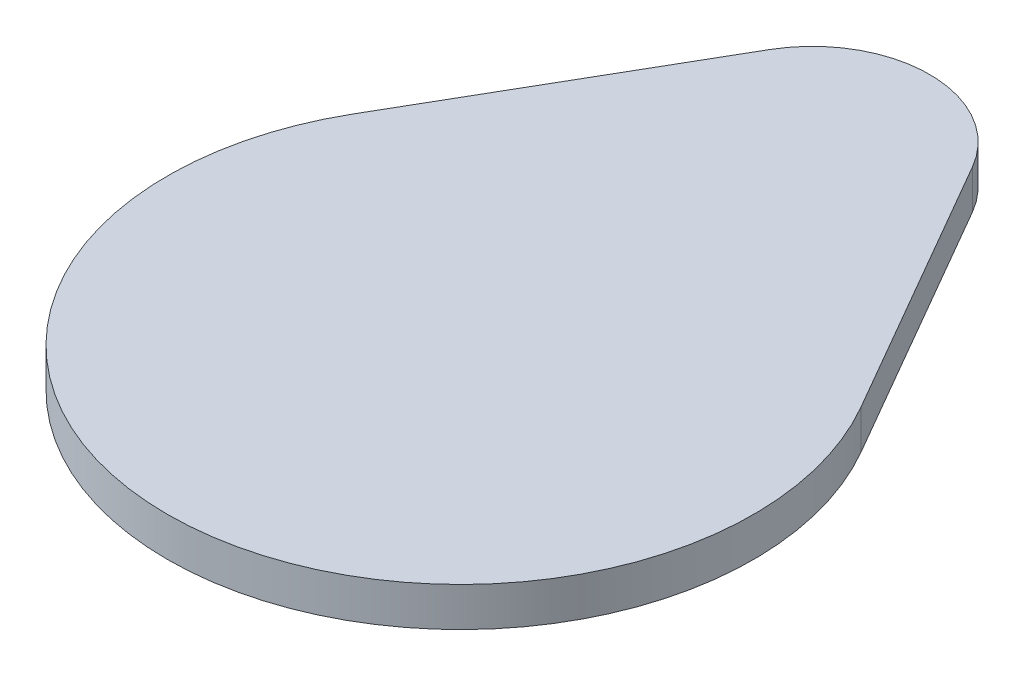
ISO-10303-21;
HEADER;
FILE_DESCRIPTION(('STEP AP214'),'2;1');
FILE_NAME('part.step','',(''),(''),'','','');
FILE_SCHEMA(('AUTOMOTIVE_DESIGN { 1 0 10303 214 1 1 1 1 }'));
ENDSEC;
DATA;
#1=APPLICATION_CONTEXT('core data for automotive mechanical design processes');
#2=APPLICATION_PROTOCOL_DEFINITION('international standard','automotive_design',2000,#1);
#3=PRODUCT_CONTEXT('',#1,'mechanical');
#4=PRODUCT('Part','Part','',(#3));
#5=PRODUCT_RELATED_PRODUCT_CATEGORY('part','',(#4));
#6=PRODUCT_DEFINITION_FORMATION('','',#4);
#7=PRODUCT_DEFINITION_CONTEXT('part definition',#1,'design');
#8=PRODUCT_DEFINITION('design','',#6,#7);
#9=PRODUCT_DEFINITION_SHAPE('','',#8);
#10=(LENGTH_UNIT() NAMED_UNIT(*) SI_UNIT(.MILLI.,.METRE.));
#11=(NAMED_UNIT(*) PLANE_ANGLE_UNIT() SI_UNIT($,.RADIAN.));
#12=(NAMED_UNIT(*) SI_UNIT($,.STERADIAN.) SOLID_ANGLE_UNIT());
#13=UNCERTAINTY_MEASURE_WITH_UNIT(LENGTH_MEASURE(1.E-05),#10,'distance_accuracy_value','');
#14=(GEOMETRIC_REPRESENTATION_CONTEXT(3) GLOBAL_UNCERTAINTY_ASSIGNED_CONTEXT((#13)) GLOBAL_UNIT_ASSIGNED_CONTEXT((#10,
#11,#12)) REPRESENTATION_CONTEXT('',''));
#15=CARTESIAN_POINT('',(0.,0.,0.));
#16=DIRECTION('',(0.,0.,1.));
#17=DIRECTION('',(1.,0.,0.));
#18=AXIS2_PLACEMENT_3D('',#15,#16,#17);
#19=CARTESIAN_POINT('',(-6.49519052838329,1.,-3.75));
#20=DIRECTION('',(0.866025403784439,0.,0.5));
#21=DIRECTION('',(0.5,0.,-0.866025403784439));
#22=AXIS2_PLACEMENT_3D('',#19,#20,#21);
#23=PLANE('',#22);
#24=DIRECTION('',(-0.5,0.,0.866025403784439));
#25=VECTOR('',#24,1.);
#26=CARTESIAN_POINT('',(-6.49519052838329,1.,-3.75));
#27=LINE('',#26,#25);
#28=CARTESIAN_POINT('',(-2.59807621135331,1.,-10.5));
#29=VERTEX_POINT('',#28);
#30=CARTESIAN_POINT('',(-6.49519052838329,1.,-3.75));
#31=VERTEX_POINT('',#30);
#32=EDGE_CURVE('E72',#29,#31,#27,.T.);
#33=ORIENTED_EDGE('',*,*,#32,.F.);
#34=DIRECTION('',(0.,-1.,0.));
#35=VECTOR('',#34,1.);
#36=CARTESIAN_POINT('',(-2.59807621135332,0.,-10.5));
#37=LINE('',#36,#35);
#38=CARTESIAN_POINT('',(-2.59807621135331,0.,-10.5));
#39=VERTEX_POINT('',#38);
#40=EDGE_CURVE('E95',#29,#39,#37,.T.);
#41=ORIENTED_EDGE('',*,*,#40,.T.);
#42=DIRECTION('',(-0.5,0.,0.866025403784439));
#43=VECTOR('',#42,1.);
#44=CARTESIAN_POINT('',(-6.49519052838329,0.,-3.75));
#45=LINE('',#44,#43);
#46=CARTESIAN_POINT('',(-6.49519052838329,0.,-3.75));
#47=VERTEX_POINT('',#46);
#48=EDGE_CURVE('E93',#39,#47,#45,.T.);
#49=ORIENTED_EDGE('',*,*,#48,.T.);
#50=DIRECTION('',(0.,-1.,0.));
#51=VECTOR('',#50,1.);
#52=CARTESIAN_POINT('',(-6.49519052838329,1.,-3.75));
#53=LINE('',#52,#51);
#54=EDGE_CURVE('E88',#31,#47,#53,.T.);
#55=ORIENTED_EDGE('',*,*,#54,.F.);
#56=EDGE_LOOP('',(#33,#41,#49,#55));
#57=FACE_BOUND('',#56,.T.);
#58=ADVANCED_FACE('F33',(#57),#23,.F.);
#59=CARTESIAN_POINT('',(0.,1.,0.));
#60=DIRECTION('',(0.,-1.,0.));
#61=DIRECTION('',(0.,0.,-1.));
#62=AXIS2_PLACEMENT_3D('',#59,#60,#61);
#63=CYLINDRICAL_SURFACE('',#62,7.5);
#64=CARTESIAN_POINT('',(0.,0.,0.));
#65=DIRECTION('',(0.,1.,0.));
#66=DIRECTION('',(0.,0.,1.));
#67=AXIS2_PLACEMENT_3D('',#64,#65,#66);
#68=CIRCLE('',#67,7.5);
#69=CARTESIAN_POINT('',(6.49519052838329,0.,-3.75));
#70=VERTEX_POINT('',#69);
#71=EDGE_CURVE('E102',#47,#70,#68,.T.);
#72=ORIENTED_EDGE('',*,*,#71,.T.);
#73=DIRECTION('',(0.,-1.,0.));
#74=VECTOR('',#73,1.);
#75=CARTESIAN_POINT('',(6.49519052838329,1.,-3.75));
#76=LINE('',#75,#74);
#77=CARTESIAN_POINT('',(6.49519052838329,1.,-3.75));
#78=VERTEX_POINT('',#77);
#79=EDGE_CURVE('E90',#78,#70,#76,.T.);
#80=ORIENTED_EDGE('',*,*,#79,.F.);
#81=CARTESIAN_POINT('',(0.,1.,0.));
#82=DIRECTION('',(0.,1.,0.));
#83=DIRECTION('',(0.,0.,1.));
#84=AXIS2_PLACEMENT_3D('',#81,#82,#83);
#85=CIRCLE('',#84,7.5);
#86=EDGE_CURVE('E75',#31,#78,#85,.T.);
#87=ORIENTED_EDGE('',*,*,#86,.F.);
#88=ORIENTED_EDGE('',*,*,#54,.T.);
#89=EDGE_LOOP('',(#72,#80,#87,#88));
#90=FACE_BOUND('',#89,.T.);
#91=ADVANCED_FACE('F87',(#90),#63,.T.);
#92=CARTESIAN_POINT('',(6.49519052838329,1.,-3.75));
#93=DIRECTION('',(0.866025403784439,0.,-0.5));
#94=DIRECTION('',(-0.5,0.,-0.866025403784439));
#95=AXIS2_PLACEMENT_3D('',#92,#93,#94);
#96=PLANE('',#95);
#97=DIRECTION('',(0.5,0.,0.866025403784439));
#98=VECTOR('',#97,1.);
#99=CARTESIAN_POINT('',(6.49519052838329,0.,-3.75));
#100=LINE('',#99,#98);
#101=CARTESIAN_POINT('',(2.59807621135332,0.,-10.5));
#102=VERTEX_POINT('',#101);
#103=EDGE_CURVE('E82',#102,#70,#100,.T.);
#104=ORIENTED_EDGE('',*,*,#103,.F.);
#105=DIRECTION('',(0.,-1.,0.));
#106=VECTOR('',#105,1.);
#107=CARTESIAN_POINT('',(2.59807621135332,1.,-10.5));
#108=LINE('',#107,#106);
#109=CARTESIAN_POINT('',(2.59807621135332,1.,-10.5));
#110=VERTEX_POINT('',#109);
#111=EDGE_CURVE('E41',#102,#110,#108,.F.);
#112=ORIENTED_EDGE('',*,*,#111,.T.);
#113=DIRECTION('',(0.5,0.,0.866025403784439));
#114=VECTOR('',#113,1.);
#115=CARTESIAN_POINT('',(6.49519052838329,1.,-3.75));
#116=LINE('',#115,#114);
#117=EDGE_CURVE('E91',#110,#78,#116,.T.);
#118=ORIENTED_EDGE('',*,*,#117,.T.);
#119=ORIENTED_EDGE('',*,*,#79,.T.);
#120=EDGE_LOOP('',(#104,#112,#118,#119));
#121=FACE_BOUND('',#120,.T.);
#122=ADVANCED_FACE('F105',(#121),#96,.T.);
#123=CARTESIAN_POINT('',(0.,1.,0.));
#124=DIRECTION('',(0.,1.,0.));
#125=DIRECTION('',(0.,0.,1.));
#126=AXIS2_PLACEMENT_3D('',#123,#124,#125);
#127=PLANE('',#126);
#128=ORIENTED_EDGE('',*,*,#117,.F.);
#129=CARTESIAN_POINT('',(0.,1.,-9.));
#130=DIRECTION('',(0.,1.,0.));
#131=DIRECTION('',(0.,0.,1.));
#132=AXIS2_PLACEMENT_3D('',#129,#130,#131);
#133=CIRCLE('',#132,3.);
#134=EDGE_CURVE('E11',#110,#29,#133,.T.);
#135=ORIENTED_EDGE('',*,*,#134,.T.);
#136=ORIENTED_EDGE('',*,*,#32,.T.);
#137=ORIENTED_EDGE('',*,*,#86,.T.);
#138=EDGE_LOOP('',(#128,#135,#136,#137));
#139=FACE_BOUND('',#138,.T.);
#140=ADVANCED_FACE('F74',(#139),#127,.T.);
#141=CARTESIAN_POINT('',(0.,0.,0.));
#142=DIRECTION('',(0.,1.,0.));
#143=DIRECTION('',(0.,0.,1.));
#144=AXIS2_PLACEMENT_3D('',#141,#142,#143);
#145=PLANE('',#144);
#146=ORIENTED_EDGE('',*,*,#48,.F.);
#147=CARTESIAN_POINT('',(0.,0.,-9.));
#148=DIRECTION('',(0.,1.,0.));
#149=DIRECTION('',(0.,0.,1.));
#150=AXIS2_PLACEMENT_3D('',#147,#148,#149);
#151=CIRCLE('',#150,3.);
#152=EDGE_CURVE('E55',#39,#102,#151,.F.);
#153=ORIENTED_EDGE('',*,*,#152,.T.);
#154=ORIENTED_EDGE('',*,*,#103,.T.);
#155=ORIENTED_EDGE('',*,*,#71,.F.);
#156=EDGE_LOOP('',(#146,#153,#154,#155));
#157=FACE_BOUND('',#156,.T.);
#158=ADVANCED_FACE('F107',(#157),#145,.F.);
#159=CARTESIAN_POINT('',(0.,1.,-9.));
#160=DIRECTION('',(0.,1.,0.));
#161=DIRECTION('',(0.,0.,1.));
#162=AXIS2_PLACEMENT_3D('',#159,#160,#161);
#163=CYLINDRICAL_SURFACE('',#162,3.);
#164=ORIENTED_EDGE('',*,*,#134,.F.);
#165=ORIENTED_EDGE('',*,*,#111,.F.);
#166=ORIENTED_EDGE('',*,*,#152,.F.);
#167=ORIENTED_EDGE('',*,*,#40,.F.);
#168=EDGE_LOOP('',(#164,#165,#166,#167));
#169=FACE_BOUND('',#168,.T.);
#170=ADVANCED_FACE('F35',(#169),#163,.T.);
#171=CLOSED_SHELL('',(#58,#91,#122,#140,#158,#170));
#172=MANIFOLD_SOLID_BREP('B2',#171);
#173=ADVANCED_BREP_SHAPE_REPRESENTATION('',(#18,#172),#14);
#174=SHAPE_DEFINITION_REPRESENTATION(#9,#173);
ENDSEC;
END-ISO-10303-21;
